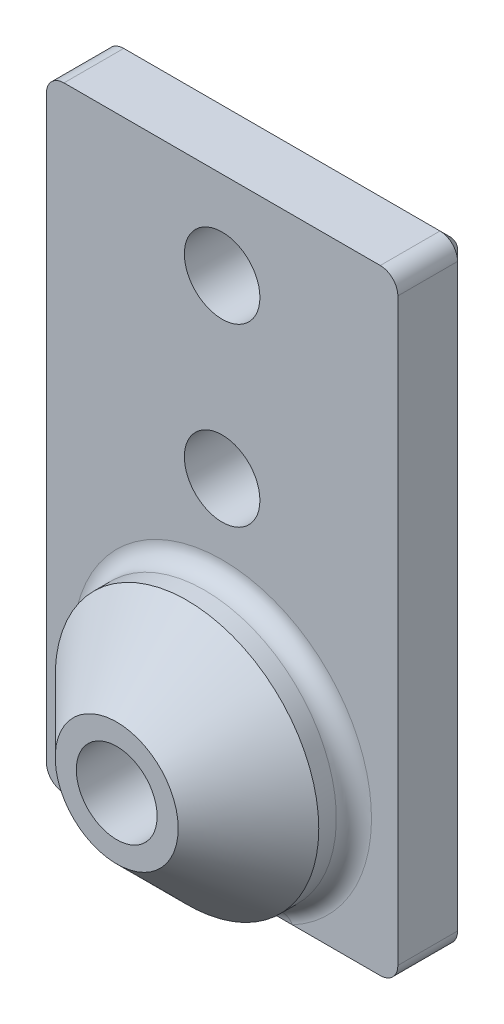
ISO-10303-21;
HEADER;
FILE_DESCRIPTION(('STEP AP214'),'2;1');
FILE_NAME('part.step','',(''),(''),'','','');
FILE_SCHEMA(('AUTOMOTIVE_DESIGN { 1 0 10303 214 1 1 1 1 }'));
ENDSEC;
DATA;
#1=APPLICATION_CONTEXT('core data for automotive mechanical design processes');
#2=APPLICATION_PROTOCOL_DEFINITION('international standard','automotive_design',2000,#1);
#3=PRODUCT_CONTEXT('',#1,'mechanical');
#4=PRODUCT('Part','Part','',(#3));
#5=PRODUCT_RELATED_PRODUCT_CATEGORY('part','',(#4));
#6=PRODUCT_DEFINITION_FORMATION('','',#4);
#7=PRODUCT_DEFINITION_CONTEXT('part definition',#1,'design');
#8=PRODUCT_DEFINITION('design','',#6,#7);
#9=PRODUCT_DEFINITION_SHAPE('','',#8);
#10=(LENGTH_UNIT() NAMED_UNIT(*) SI_UNIT(.MILLI.,.METRE.));
#11=(NAMED_UNIT(*) PLANE_ANGLE_UNIT() SI_UNIT($,.RADIAN.));
#12=(NAMED_UNIT(*) SI_UNIT($,.STERADIAN.) SOLID_ANGLE_UNIT());
#13=UNCERTAINTY_MEASURE_WITH_UNIT(LENGTH_MEASURE(1.E-05),#10,'distance_accuracy_value','');
#14=(GEOMETRIC_REPRESENTATION_CONTEXT(3) GLOBAL_UNCERTAINTY_ASSIGNED_CONTEXT((#13)) GLOBAL_UNIT_ASSIGNED_CONTEXT((#10,
#11,#12)) REPRESENTATION_CONTEXT('',''));
#15=CARTESIAN_POINT('',(0.,0.,0.));
#16=DIRECTION('',(0.,0.,1.));
#17=DIRECTION('',(1.,0.,0.));
#18=AXIS2_PLACEMENT_3D('',#15,#16,#17);
#19=CARTESIAN_POINT('',(0.,0.,4.));
#20=DIRECTION('',(0.,0.,1.));
#21=DIRECTION('',(1.,0.,0.));
#22=AXIS2_PLACEMENT_3D('',#19,#20,#21);
#23=PLANE('',#22);
#24=CARTESIAN_POINT('',(-10.,30.,4.));
#25=DIRECTION('',(0.,0.,1.));
#26=DIRECTION('',(1.,0.,0.));
#27=AXIS2_PLACEMENT_3D('',#24,#25,#26);
#28=CIRCLE('',#27,2.15);
#29=CARTESIAN_POINT('',(-7.85,30.,4.));
#30=VERTEX_POINT('',#29);
#31=EDGE_CURVE('E370',#30,#30,#28,.T.);
#32=ORIENTED_EDGE('',*,*,#31,.F.);
#33=EDGE_LOOP('',(#32));
#34=FACE_BOUND('',#33,.T.);
#35=DIRECTION('',(1.,0.,0.));
#36=VECTOR('',#35,1.);
#37=CARTESIAN_POINT('',(0.,0.,4.));
#38=LINE('',#37,#36);
#39=CARTESIAN_POINT('',(-19.,0.,4.));
#40=VERTEX_POINT('',#39);
#41=CARTESIAN_POINT('',(-14.,0.,4.));
#42=VERTEX_POINT('',#41);
#43=EDGE_CURVE('E180',#40,#42,#38,.T.);
#44=ORIENTED_EDGE('',*,*,#43,.T.);
#45=CARTESIAN_POINT('',(-10.,7.5,4.));
#46=DIRECTION('',(0.,0.,1.));
#47=DIRECTION('',(1.,0.,0.));
#48=AXIS2_PLACEMENT_3D('',#45,#46,#47);
#49=CIRCLE('',#48,8.5);
#50=CARTESIAN_POINT('',(-6.,0.,4.));
#51=VERTEX_POINT('',#50);
#52=EDGE_CURVE('E763',#42,#51,#49,.F.);
#53=ORIENTED_EDGE('',*,*,#52,.T.);
#54=CARTESIAN_POINT('',(-1.,0.,4.));
#55=VERTEX_POINT('',#54);
#56=EDGE_CURVE('E175',#51,#55,#38,.T.);
#57=ORIENTED_EDGE('',*,*,#56,.T.);
#58=CARTESIAN_POINT('',(-1.,1.,4.));
#59=DIRECTION('',(0.,0.,1.));
#60=DIRECTION('',(1.,0.,0.));
#61=AXIS2_PLACEMENT_3D('',#58,#59,#60);
#62=CIRCLE('',#61,1.);
#63=CARTESIAN_POINT('',(0.,1.,4.));
#64=VERTEX_POINT('',#63);
#65=EDGE_CURVE('E188',#55,#64,#62,.T.);
#66=ORIENTED_EDGE('',*,*,#65,.T.);
#67=DIRECTION('',(0.,1.,0.));
#68=VECTOR('',#67,1.);
#69=CARTESIAN_POINT('',(0.,0.,4.));
#70=LINE('',#69,#68);
#71=CARTESIAN_POINT('',(0.,34.,4.));
#72=VERTEX_POINT('',#71);
#73=EDGE_CURVE('E381',#64,#72,#70,.T.);
#74=ORIENTED_EDGE('',*,*,#73,.T.);
#75=CARTESIAN_POINT('',(-1.,34.,4.));
#76=DIRECTION('',(0.,0.,1.));
#77=DIRECTION('',(1.,0.,0.));
#78=AXIS2_PLACEMENT_3D('',#75,#76,#77);
#79=CIRCLE('',#78,1.);
#80=CARTESIAN_POINT('',(-1.,35.,4.));
#81=VERTEX_POINT('',#80);
#82=EDGE_CURVE('E766',#72,#81,#79,.T.);
#83=ORIENTED_EDGE('',*,*,#82,.T.);
#84=DIRECTION('',(-1.,0.,0.));
#85=VECTOR('',#84,1.);
#86=CARTESIAN_POINT('',(0.,35.,4.));
#87=LINE('',#86,#85);
#88=CARTESIAN_POINT('',(-19.,35.,4.));
#89=VERTEX_POINT('',#88);
#90=EDGE_CURVE('E391',#81,#89,#87,.T.);
#91=ORIENTED_EDGE('',*,*,#90,.T.);
#92=CARTESIAN_POINT('',(-19.,34.,4.));
#93=DIRECTION('',(0.,0.,1.));
#94=DIRECTION('',(1.,0.,0.));
#95=AXIS2_PLACEMENT_3D('',#92,#93,#94);
#96=CIRCLE('',#95,1.);
#97=CARTESIAN_POINT('',(-20.,34.,4.));
#98=VERTEX_POINT('',#97);
#99=EDGE_CURVE('E769',#89,#98,#96,.T.);
#100=ORIENTED_EDGE('',*,*,#99,.T.);
#101=DIRECTION('',(0.,-1.,0.));
#102=VECTOR('',#101,1.);
#103=CARTESIAN_POINT('',(-20.,0.,4.));
#104=LINE('',#103,#102);
#105=CARTESIAN_POINT('',(-20.,1.,4.));
#106=VERTEX_POINT('',#105);
#107=EDGE_CURVE('E395',#98,#106,#104,.T.);
#108=ORIENTED_EDGE('',*,*,#107,.T.);
#109=CARTESIAN_POINT('',(-19.,1.,4.));
#110=DIRECTION('',(0.,0.,1.));
#111=DIRECTION('',(1.,0.,0.));
#112=AXIS2_PLACEMENT_3D('',#109,#110,#111);
#113=CIRCLE('',#112,1.);
#114=EDGE_CURVE('E192',#106,#40,#113,.T.);
#115=ORIENTED_EDGE('',*,*,#114,.T.);
#116=EDGE_LOOP('',(#44,#53,#57,#66,#74,#83,#91,#100,#108,#115));
#117=FACE_BOUND('',#116,.T.);
#118=CARTESIAN_POINT('',(-10.,20.,4.));
#119=DIRECTION('',(0.,0.,1.));
#120=DIRECTION('',(1.,0.,0.));
#121=AXIS2_PLACEMENT_3D('',#118,#119,#120);
#122=CIRCLE('',#121,2.15);
#123=CARTESIAN_POINT('',(-7.85,20.,4.));
#124=VERTEX_POINT('',#123);
#125=EDGE_CURVE('E374',#124,#124,#122,.T.);
#126=ORIENTED_EDGE('',*,*,#125,.F.);
#127=EDGE_LOOP('',(#126));
#128=FACE_BOUND('',#127,.T.);
#129=ADVANCED_FACE('F43',(#34,#117,#128),#23,.T.);
#130=CARTESIAN_POINT('',(0.,0.,0.));
#131=DIRECTION('',(0.,0.,1.));
#132=DIRECTION('',(1.,0.,0.));
#133=AXIS2_PLACEMENT_3D('',#130,#131,#132);
#134=PLANE('',#133);
#135=CARTESIAN_POINT('',(-10.,20.,0.));
#136=DIRECTION('',(0.,0.,1.));
#137=DIRECTION('',(1.,0.,0.));
#138=AXIS2_PLACEMENT_3D('',#135,#136,#137);
#139=CIRCLE('',#138,2.75);
#140=CARTESIAN_POINT('',(-7.25,20.,0.));
#141=VERTEX_POINT('',#140);
#142=EDGE_CURVE('E643',#141,#141,#139,.T.);
#143=ORIENTED_EDGE('',*,*,#142,.T.);
#144=EDGE_LOOP('',(#143));
#145=FACE_BOUND('',#144,.T.);
#146=CARTESIAN_POINT('',(-10.,30.,0.));
#147=DIRECTION('',(0.,0.,1.));
#148=DIRECTION('',(1.,0.,0.));
#149=AXIS2_PLACEMENT_3D('',#146,#147,#148);
#150=CIRCLE('',#149,2.75000000000001);
#151=CARTESIAN_POINT('',(-7.25,30.,0.));
#152=VERTEX_POINT('',#151);
#153=EDGE_CURVE('E714',#152,#152,#150,.T.);
#154=ORIENTED_EDGE('',*,*,#153,.T.);
#155=EDGE_LOOP('',(#154));
#156=FACE_BOUND('',#155,.T.);
#157=DIRECTION('',(0.,1.,0.));
#158=VECTOR('',#157,1.);
#159=CARTESIAN_POINT('',(-19.4,0.,0.));
#160=LINE('',#159,#158);
#161=CARTESIAN_POINT('',(-19.4,1.,0.));
#162=VERTEX_POINT('',#161);
#163=CARTESIAN_POINT('',(-19.4,34.,0.));
#164=VERTEX_POINT('',#163);
#165=EDGE_CURVE('E707',#162,#164,#160,.T.);
#166=ORIENTED_EDGE('',*,*,#165,.T.);
#167=CARTESIAN_POINT('',(-19.,34.,0.));
#168=DIRECTION('',(0.,0.,1.));
#169=DIRECTION('',(1.,0.,0.));
#170=AXIS2_PLACEMENT_3D('',#167,#168,#169);
#171=CIRCLE('',#170,0.399999999999998);
#172=CARTESIAN_POINT('',(-19.,34.4,0.));
#173=VERTEX_POINT('',#172);
#174=EDGE_CURVE('E710',#164,#173,#171,.F.);
#175=ORIENTED_EDGE('',*,*,#174,.T.);
#176=DIRECTION('',(1.,0.,0.));
#177=VECTOR('',#176,1.);
#178=CARTESIAN_POINT('',(0.,34.4,0.));
#179=LINE('',#178,#177);
#180=CARTESIAN_POINT('',(-1.,34.4,0.));
#181=VERTEX_POINT('',#180);
#182=EDGE_CURVE('E277',#173,#181,#179,.T.);
#183=ORIENTED_EDGE('',*,*,#182,.T.);
#184=CARTESIAN_POINT('',(-1.,34.,0.));
#185=DIRECTION('',(0.,0.,1.));
#186=DIRECTION('',(1.,0.,0.));
#187=AXIS2_PLACEMENT_3D('',#184,#185,#186);
#188=CIRCLE('',#187,0.399999999999997);
#189=CARTESIAN_POINT('',(-0.600000000000003,34.,0.));
#190=VERTEX_POINT('',#189);
#191=EDGE_CURVE('E702',#181,#190,#188,.F.);
#192=ORIENTED_EDGE('',*,*,#191,.T.);
#193=DIRECTION('',(0.,-1.,0.));
#194=VECTOR('',#193,1.);
#195=CARTESIAN_POINT('',(-0.600000000000003,0.,0.));
#196=LINE('',#195,#194);
#197=CARTESIAN_POINT('',(-0.600000000000003,1.,0.));
#198=VERTEX_POINT('',#197);
#199=EDGE_CURVE('E688',#190,#198,#196,.T.);
#200=ORIENTED_EDGE('',*,*,#199,.T.);
#201=CARTESIAN_POINT('',(-1.,1.,0.));
#202=DIRECTION('',(0.,0.,1.));
#203=DIRECTION('',(1.,0.,0.));
#204=AXIS2_PLACEMENT_3D('',#201,#202,#203);
#205=CIRCLE('',#204,0.399999999999997);
#206=CARTESIAN_POINT('',(-1.,0.600000000000003,0.));
#207=VERTEX_POINT('',#206);
#208=EDGE_CURVE('E692',#198,#207,#205,.F.);
#209=ORIENTED_EDGE('',*,*,#208,.T.);
#210=DIRECTION('',(-1.,0.,0.));
#211=VECTOR('',#210,1.);
#212=CARTESIAN_POINT('',(0.,0.600000000000003,0.));
#213=LINE('',#212,#211);
#214=CARTESIAN_POINT('',(-19.,0.600000000000003,0.));
#215=VERTEX_POINT('',#214);
#216=EDGE_CURVE('E696',#207,#215,#213,.T.);
#217=ORIENTED_EDGE('',*,*,#216,.T.);
#218=CARTESIAN_POINT('',(-19.,1.,0.));
#219=DIRECTION('',(0.,0.,1.));
#220=DIRECTION('',(1.,0.,0.));
#221=AXIS2_PLACEMENT_3D('',#218,#219,#220);
#222=CIRCLE('',#221,0.399999999999998);
#223=EDGE_CURVE('E700',#215,#162,#222,.F.);
#224=ORIENTED_EDGE('',*,*,#223,.T.);
#225=EDGE_LOOP('',(#166,#175,#183,#192,#200,#209,#217,#224));
#226=FACE_BOUND('',#225,.T.);
#227=ADVANCED_FACE('F246',(#145,#156,#226),#134,.F.);
#228=CARTESIAN_POINT('',(0.,0.,4.));
#229=DIRECTION('',(-1.,0.,0.));
#230=DIRECTION('',(0.,0.,1.));
#231=AXIS2_PLACEMENT_3D('',#228,#229,#230);
#232=PLANE('',#231);
#233=DIRECTION('',(0.,0.,-1.));
#234=VECTOR('',#233,1.);
#235=CARTESIAN_POINT('',(0.,1.,4.));
#236=LINE('',#235,#234);
#237=CARTESIAN_POINT('',(0.,1.,0.600000000000007));
#238=VERTEX_POINT('',#237);
#239=EDGE_CURVE('E754',#64,#238,#236,.T.);
#240=ORIENTED_EDGE('',*,*,#239,.T.);
#241=DIRECTION('',(0.,1.,0.));
#242=VECTOR('',#241,1.);
#243=CARTESIAN_POINT('',(0.,0.,0.600000000000007));
#244=LINE('',#243,#242);
#245=CARTESIAN_POINT('',(0.,34.,0.600000000000007));
#246=VERTEX_POINT('',#245);
#247=EDGE_CURVE('E69',#238,#246,#244,.T.);
#248=ORIENTED_EDGE('',*,*,#247,.T.);
#249=DIRECTION('',(0.,0.,-1.));
#250=VECTOR('',#249,1.);
#251=CARTESIAN_POINT('',(0.,34.,4.));
#252=LINE('',#251,#250);
#253=EDGE_CURVE('E751',#246,#72,#252,.F.);
#254=ORIENTED_EDGE('',*,*,#253,.T.);
#255=ORIENTED_EDGE('',*,*,#73,.F.);
#256=EDGE_LOOP('',(#240,#248,#254,#255));
#257=FACE_BOUND('',#256,.T.);
#258=ADVANCED_FACE('F242',(#257),#232,.F.);
#259=CARTESIAN_POINT('',(0.,35.,4.));
#260=DIRECTION('',(0.,-1.,0.));
#261=DIRECTION('',(0.,0.,-1.));
#262=AXIS2_PLACEMENT_3D('',#259,#260,#261);
#263=PLANE('',#262);
#264=DIRECTION('',(0.,0.,-1.));
#265=VECTOR('',#264,1.);
#266=CARTESIAN_POINT('',(-1.,35.,4.));
#267=LINE('',#266,#265);
#268=CARTESIAN_POINT('',(-1.,35.,0.600000000000007));
#269=VERTEX_POINT('',#268);
#270=EDGE_CURVE('E757',#81,#269,#267,.T.);
#271=ORIENTED_EDGE('',*,*,#270,.T.);
#272=DIRECTION('',(-1.,0.,0.));
#273=VECTOR('',#272,1.);
#274=CARTESIAN_POINT('',(0.,35.,0.600000000000007));
#275=LINE('',#274,#273);
#276=CARTESIAN_POINT('',(-19.,35.,0.600000000000007));
#277=VERTEX_POINT('',#276);
#278=EDGE_CURVE('E11',#269,#277,#275,.T.);
#279=ORIENTED_EDGE('',*,*,#278,.T.);
#280=DIRECTION('',(0.,0.,-1.));
#281=VECTOR('',#280,1.);
#282=CARTESIAN_POINT('',(-19.,35.,4.));
#283=LINE('',#282,#281);
#284=EDGE_CURVE('E760',#277,#89,#283,.F.);
#285=ORIENTED_EDGE('',*,*,#284,.T.);
#286=ORIENTED_EDGE('',*,*,#90,.F.);
#287=EDGE_LOOP('',(#271,#279,#285,#286));
#288=FACE_BOUND('',#287,.T.);
#289=ADVANCED_FACE('F245',(#288),#263,.F.);
#290=CARTESIAN_POINT('',(-20.,0.,4.));
#291=DIRECTION('',(1.,0.,0.));
#292=DIRECTION('',(0.,1.,0.));
#293=AXIS2_PLACEMENT_3D('',#290,#291,#292);
#294=PLANE('',#293);
#295=DIRECTION('',(0.,0.,-1.));
#296=VECTOR('',#295,1.);
#297=CARTESIAN_POINT('',(-20.,34.,4.));
#298=LINE('',#297,#296);
#299=CARTESIAN_POINT('',(-20.,34.,0.600000000000007));
#300=VERTEX_POINT('',#299);
#301=EDGE_CURVE('E742',#98,#300,#298,.T.);
#302=ORIENTED_EDGE('',*,*,#301,.T.);
#303=DIRECTION('',(0.,-1.,0.));
#304=VECTOR('',#303,1.);
#305=CARTESIAN_POINT('',(-20.,0.,0.600000000000007));
#306=LINE('',#305,#304);
#307=CARTESIAN_POINT('',(-20.,1.,0.600000000000007));
#308=VERTEX_POINT('',#307);
#309=EDGE_CURVE('E640',#300,#308,#306,.T.);
#310=ORIENTED_EDGE('',*,*,#309,.T.);
#311=DIRECTION('',(0.,0.,-1.));
#312=VECTOR('',#311,1.);
#313=CARTESIAN_POINT('',(-20.,1.,4.));
#314=LINE('',#313,#312);
#315=EDGE_CURVE('E746',#308,#106,#314,.F.);
#316=ORIENTED_EDGE('',*,*,#315,.T.);
#317=ORIENTED_EDGE('',*,*,#107,.F.);
#318=EDGE_LOOP('',(#302,#310,#316,#317));
#319=FACE_BOUND('',#318,.T.);
#320=ADVANCED_FACE('F249',(#319),#294,.F.);
#321=CARTESIAN_POINT('',(0.,0.,4.));
#322=DIRECTION('',(0.,1.,0.));
#323=DIRECTION('',(0.,0.,1.));
#324=AXIS2_PLACEMENT_3D('',#321,#322,#323);
#325=PLANE('',#324);
#326=DIRECTION('',(0.,0.,-1.));
#327=VECTOR('',#326,1.);
#328=CARTESIAN_POINT('',(-19.,0.,4.));
#329=LINE('',#328,#327);
#330=CARTESIAN_POINT('',(-19.,0.,0.600000000000007));
#331=VERTEX_POINT('',#330);
#332=EDGE_CURVE('E423',#40,#331,#329,.T.);
#333=ORIENTED_EDGE('',*,*,#332,.T.);
#334=DIRECTION('',(1.,0.,0.));
#335=VECTOR('',#334,1.);
#336=CARTESIAN_POINT('',(0.,0.,0.600000000000007));
#337=LINE('',#336,#335);
#338=CARTESIAN_POINT('',(-1.,0.,0.600000000000007));
#339=VERTEX_POINT('',#338);
#340=EDGE_CURVE('E652',#331,#339,#337,.T.);
#341=ORIENTED_EDGE('',*,*,#340,.T.);
#342=DIRECTION('',(0.,0.,-1.));
#343=VECTOR('',#342,1.);
#344=CARTESIAN_POINT('',(-1.,0.,4.));
#345=LINE('',#344,#343);
#346=EDGE_CURVE('E738',#339,#55,#345,.F.);
#347=ORIENTED_EDGE('',*,*,#346,.T.);
#348=ORIENTED_EDGE('',*,*,#56,.F.);
#349=CARTESIAN_POINT('',(-10.,0.,4.));
#350=VERTEX_POINT('',#349);
#351=EDGE_CURVE('E168',#350,#51,#38,.T.);
#352=ORIENTED_EDGE('',*,*,#351,.F.);
#353=EDGE_CURVE('E172',#42,#350,#38,.T.);
#354=ORIENTED_EDGE('',*,*,#353,.F.);
#355=ORIENTED_EDGE('',*,*,#43,.F.);
#356=EDGE_LOOP('',(#333,#341,#347,#348,#352,#354,#355));
#357=FACE_BOUND('',#356,.T.);
#358=ADVANCED_FACE('F170',(#357),#325,.F.);
#359=CARTESIAN_POINT('',(-10.,30.,4.));
#360=DIRECTION('',(0.,0.,-1.));
#361=DIRECTION('',(-1.,0.,0.));
#362=AXIS2_PLACEMENT_3D('',#359,#360,#361);
#363=CYLINDRICAL_SURFACE('',#362,2.15);
#364=CARTESIAN_POINT('',(-10.,30.,0.600000000000007));
#365=DIRECTION('',(0.,0.,1.));
#366=DIRECTION('',(1.,0.,0.));
#367=AXIS2_PLACEMENT_3D('',#364,#365,#366);
#368=CIRCLE('',#367,2.15);
#369=CARTESIAN_POINT('',(-7.85,30.,0.600000000000007));
#370=VERTEX_POINT('',#369);
#371=EDGE_CURVE('E632',#370,#370,#368,.F.);
#372=ORIENTED_EDGE('',*,*,#371,.T.);
#373=EDGE_LOOP('',(#372));
#374=FACE_BOUND('',#373,.T.);
#375=ORIENTED_EDGE('',*,*,#31,.T.);
#376=EDGE_LOOP('',(#375));
#377=FACE_BOUND('',#376,.T.);
#378=ADVANCED_FACE('F257',(#374,#377),#363,.F.);
#379=CARTESIAN_POINT('',(-10.,20.,4.));
#380=DIRECTION('',(0.,0.,-1.));
#381=DIRECTION('',(-1.,0.,0.));
#382=AXIS2_PLACEMENT_3D('',#379,#380,#381);
#383=CYLINDRICAL_SURFACE('',#382,2.15);
#384=CARTESIAN_POINT('',(-10.,20.,0.599999999999997));
#385=DIRECTION('',(0.,0.,1.));
#386=DIRECTION('',(1.,0.,0.));
#387=AXIS2_PLACEMENT_3D('',#384,#385,#386);
#388=CIRCLE('',#387,2.15);
#389=CARTESIAN_POINT('',(-7.85,20.,0.599999999999997));
#390=VERTEX_POINT('',#389);
#391=EDGE_CURVE('E635',#390,#390,#388,.F.);
#392=ORIENTED_EDGE('',*,*,#391,.T.);
#393=EDGE_LOOP('',(#392));
#394=FACE_BOUND('',#393,.T.);
#395=ORIENTED_EDGE('',*,*,#125,.T.);
#396=EDGE_LOOP('',(#395));
#397=FACE_BOUND('',#396,.T.);
#398=ADVANCED_FACE('F210',(#394,#397),#383,.F.);
#399=CARTESIAN_POINT('',(-10.,7.5,10.));
#400=DIRECTION('',(0.,0.,-1.));
#401=DIRECTION('',(-1.,0.,0.));
#402=AXIS2_PLACEMENT_3D('',#399,#400,#401);
#403=CYLINDRICAL_SURFACE('',#402,7.5);
#404=CARTESIAN_POINT('',(-10.,7.5,5.99999999999999));
#405=DIRECTION('',(0.,0.,1.));
#406=DIRECTION('',(1.,0.,0.));
#407=AXIS2_PLACEMENT_3D('',#404,#405,#406);
#408=CIRCLE('',#407,7.5);
#409=CARTESIAN_POINT('',(-2.5,7.5,5.99999999999999));
#410=VERTEX_POINT('',#409);
#411=EDGE_CURVE('E163',#410,#410,#408,.F.);
#412=ORIENTED_EDGE('',*,*,#411,.T.);
#413=EDGE_LOOP('',(#412));
#414=FACE_BOUND('',#413,.T.);
#415=CARTESIAN_POINT('',(-14.1649475880082,1.26275609029561,4.90229289493559));
#416=CARTESIAN_POINT('',(-13.8545563329807,1.05549093798143,3.49567704368993));
#417=CARTESIAN_POINT('',(-14.720273933076,0.,4.));
#418=CARTESIAN_POINT('',(-14.1081716865762,1.22482939027456,4.92276098989987));
#419=CARTESIAN_POINT('',(-13.847450596458,1.05467265586705,3.55648185499084));
#420=CARTESIAN_POINT('',(-14.6559279115267,0.,4.));
#421=CARTESIAN_POINT('',(-14.0502097337292,1.18725976905072,4.93941284545202));
#422=CARTESIAN_POINT('',(-13.8311114251331,1.04709075751968,3.61505026043743));
#423=CARTESIAN_POINT('',(-14.5902376983066,0.,4.));
#424=CARTESIAN_POINT('',(-13.9325541201053,1.11331183799878,4.96614979707921));
#425=CARTESIAN_POINT('',(-13.7843973451678,1.02251750961405,3.72306183013039));
#426=CARTESIAN_POINT('',(-14.4568946695027,0.,4.));
#427=CARTESIAN_POINT('',(-13.8728647861583,1.07693096791913,4.97625002962831));
#428=CARTESIAN_POINT('',(-13.7546079875344,1.00592715447734,3.77305899488127));
#429=CARTESIAN_POINT('',(-14.3892467576593,0.,4.));
#430=CARTESIAN_POINT('',(-13.7527153473693,1.00600559783821,4.99096212055038));
#431=CARTESIAN_POINT('',(-13.6854384794004,0.967433010639359,3.86348648380602));
#432=CARTESIAN_POINT('',(-14.2530773936721,0.,4.));
#433=CARTESIAN_POINT('',(-13.6922684287483,0.971446653440109,4.9956265221784));
#434=CARTESIAN_POINT('',(-13.6464531399414,0.945747802655388,3.90444876729883));
#435=CARTESIAN_POINT('',(-14.1845708859114,0.,4.));
#436=CARTESIAN_POINT('',(-13.5702912787392,0.903949485952248,5.00043524049742));
#437=CARTESIAN_POINT('',(-13.5613694166655,0.899347327653967,3.97834418579003));
#438=CARTESIAN_POINT('',(-14.0463301159081,0.,4.));
#439=CARTESIAN_POINT('',(-13.5087602351017,0.871012554895877,5.00057601018014));
#440=CARTESIAN_POINT('',(-13.5154033937907,0.874676048334971,4.01163415173637));
#441=CARTESIAN_POINT('',(-13.9765949331162,0.,4.));
#442=CARTESIAN_POINT('',(-13.3329493568269,0.780039416386298,4.99550686004393));
#443=CARTESIAN_POINT('',(-13.3792204070121,0.803585262072281,4.09486897573657));
#444=CARTESIAN_POINT('',(-13.7773426044021,0.,4.));
#445=CARTESIAN_POINT('',(-13.2176780323049,0.724101086614,4.98571396482374));
#446=CARTESIAN_POINT('',(-13.2811776533496,0.754499914540078,4.13868622529417));
#447=CARTESIAN_POINT('',(-13.6467017699481,0.,4.));
#448=CARTESIAN_POINT('',(-12.9852675044558,0.618539479915718,4.95624128269234));
#449=CARTESIAN_POINT('',(-13.0744301649749,0.657547653044931,4.20700267540133));
#450=CARTESIAN_POINT('',(-13.38330317172,0.,4.));
#451=CARTESIAN_POINT('',(-12.86812741034,0.568919322430786,4.93655663551524));
#452=CARTESIAN_POINT('',(-12.9655301348853,0.609317456658071,4.23256442694132));
#453=CARTESIAN_POINT('',(-13.2505443983853,0.,4.));
#454=CARTESIAN_POINT('',(-12.631666465581,0.475713675629504,4.88937034766529));
#455=CARTESIAN_POINT('',(-12.7402627084352,0.516573773962627,4.26918112839281));
#456=CARTESIAN_POINT('',(-12.9825553276585,0.,4.));
#457=CARTESIAN_POINT('',(-12.5123358764015,0.432175797421271,4.86181167536852));
#458=CARTESIAN_POINT('',(-12.6234202217676,0.471666266817686,4.2807726339324));
#459=CARTESIAN_POINT('',(-12.8473139932587,0.,4.));
#460=CARTESIAN_POINT('',(-12.2727000243456,0.351515559521142,4.80067566588278));
#461=CARTESIAN_POINT('',(-12.3853772502595,0.387403291822462,4.29270907321894));
#462=CARTESIAN_POINT('',(-12.5757266942619,0.,4.));
#463=CARTESIAN_POINT('',(-12.1523944709402,0.314395191734235,4.76709646657124));
#464=CARTESIAN_POINT('',(-12.2636952926455,0.347670357296341,4.2934127189203));
#465=CARTESIAN_POINT('',(-12.4393804003989,0.,4.));
#466=CARTESIAN_POINT('',(-11.8650094582228,0.233520160112117,4.68158689215629));
#467=CARTESIAN_POINT('',(-11.9718504877983,0.260965663687424,4.28501588070591));
#468=CARTESIAN_POINT('',(-12.1136773859859,0.,4.));
#469=CARTESIAN_POINT('',(-11.6976034654752,0.192641029846364,4.62754405559441));
#470=CARTESIAN_POINT('',(-11.7979073466423,0.215751725011192,4.27242516417799));
#471=CARTESIAN_POINT('',(-11.9239505942123,0.,4.));
#472=CARTESIAN_POINT('',(-11.3619462397298,0.122701819703047,4.5134325796347));
#473=CARTESIAN_POINT('',(-11.4475950590523,0.138386101801871,4.2365191065914));
#474=CARTESIAN_POINT('',(-11.5435390717023,0.,4.));
#475=CARTESIAN_POINT('',(-11.1936946916544,0.0936465368237265,4.4533615068454));
#476=CARTESIAN_POINT('',(-11.2698691357922,0.105625536893205,4.21330293865327));
#477=CARTESIAN_POINT('',(-11.3528539838778,0.,4.));
#478=CARTESIAN_POINT('',(-10.6892636110927,0.0240504271235652,4.26791095870411));
#479=CARTESIAN_POINT('',(-10.7405324431571,0.0282636587509294,4.1347123662954));
#480=CARTESIAN_POINT('',(-10.7811654258994,0.,4.));
#481=CARTESIAN_POINT('',(-10.352063184578,0.000706355071286015,4.13685717667344));
#482=CARTESIAN_POINT('',(-10.3756133926454,0.000812763171856406,4.06843987790779));
#483=CARTESIAN_POINT('',(-10.3990049425217,0.,4.));
#484=CARTESIAN_POINT('',(-10.0102596632133,5.26710091234347E-06,4.00398822213753));
#485=CARTESIAN_POINT('',(-10.0109436346984,5.78573264473312E-06,4.00199412971753));
#486=CARTESIAN_POINT('',(-10.0116276183084,0.,4.));
#487=CARTESIAN_POINT('',(-10.0051297670904,4.33109064626581E-09,4.00199407655141));
#488=CARTESIAN_POINT('',(-10.0054717266016,-1.84026510999685E-07,4.00099705388527));
#489=CARTESIAN_POINT('',(-10.0058137360358,0.,4.));
#490=CARTESIAN_POINT('',(-10.,0.,4.));
#491=CARTESIAN_POINT('',(-10.,0.,4.));
#492=CARTESIAN_POINT('',(-10.,0.,4.));
#493=(BOUNDED_SURFACE() B_SPLINE_SURFACE(3,2,((#415,#416,#417),(#418,#419,#420),(#421,#422,
#423),(#424,#425,#426),(#427,#428,#429),(#430,#431,#432),(#433,#434,#435),(#436,#437,#438),
(#439,#440,#441),(#442,#443,#444),(#445,#446,#447),(#448,#449,#450),(#451,#452,#453),(#454,#455,
#456),(#457,#458,#459),(#460,#461,#462),(#463,#464,#465),(#466,#467,#468),(#469,#470,#471),
(#472,#473,#474),(#475,#476,#477),(#478,#479,#480),(#481,#482,#483),(#484,#485,#486),(#487,#488,
#489),(#490,#491,#492)),.UNSPECIFIED.,.F.,.F.,.F.) B_SPLINE_SURFACE_WITH_KNOTS((4,2,2,2,2,2,2,2,
2,2,2,2,4),(3,3),(0.,0.239864757982924,0.479173354289037,0.716149064431818,0.953310584190613,
1.38922377044919,1.82535135033743,2.2647215636672,2.70422790744428,3.31148565065602,
3.91898951655747,5.12911295447538,5.14755205207324),(0.,1.),
.UNSPECIFIED.) GEOMETRIC_REPRESENTATION_ITEM() RATIONAL_B_SPLINE_SURFACE(((1.,0.566331890026464,
1.),(1.,0.581144498261973,1.),(1.,0.595533894529261,1.),(1.,0.623412455339675,1.),(1.,
0.636903629843126,1.),(1.,0.662873620182135,1.),(1.,0.675361022843118,1.),(1.,0.699497324293082,
1.),(1.,0.711145557944764,1.),(1.,0.743043242293425,1.),(1.,0.762320135751716,1.),(1.,
0.798296638400172,1.),(1.,0.814994975350845,1.),(1.,0.846103702394589,1.),(1.,0.860496158386932,
1.),(1.,0.886995872404585,1.),(1.,0.899102421023457,1.),(1.,0.925359675676646,1.),(1.,
0.93852690815901,1.),(1.,0.960967510949292,1.),(1.,0.970239300904672,1.),(1.,0.99240769859094,
1.),(1.,0.999776680741857,1.),(1.,0.999998326598449,1.),(1.,0.999999992986933,1.),(1.,1.,1.))) REPRESENTATION_ITEM('') SURFACE());
#494=CARTESIAN_POINT('',(-14.1649475880082,1.26275609029561,4.90229289493559));
#495=CARTESIAN_POINT('',(-14.1081716865762,1.22482939027456,4.92276098989987));
#496=CARTESIAN_POINT('',(-14.0502097337292,1.18725976905072,4.93941284545202));
#497=CARTESIAN_POINT('',(-13.9325541201053,1.11331183799878,4.96614979707921));
#498=CARTESIAN_POINT('',(-13.8728647861583,1.07693096791913,4.97625002962831));
#499=CARTESIAN_POINT('',(-13.7527153473693,1.00600559783821,4.99096212055038));
#500=CARTESIAN_POINT('',(-13.6922684287483,0.971446653440109,4.9956265221784));
#501=CARTESIAN_POINT('',(-13.5702912787392,0.903949485952248,5.00043524049742));
#502=CARTESIAN_POINT('',(-13.5087602351017,0.871012554895877,5.00057601018014));
#503=CARTESIAN_POINT('',(-13.3329493568269,0.780039416386298,4.99550686004393));
#504=CARTESIAN_POINT('',(-13.2176780323049,0.724101086614,4.98571396482374));
#505=CARTESIAN_POINT('',(-12.9852675044558,0.618539479915718,4.95624128269234));
#506=CARTESIAN_POINT('',(-12.86812741034,0.568919322430786,4.93655663551524));
#507=CARTESIAN_POINT('',(-12.631666465581,0.475713675629504,4.88937034766529));
#508=CARTESIAN_POINT('',(-12.5123358764015,0.432175797421271,4.86181167536852));
#509=CARTESIAN_POINT('',(-12.2727000243456,0.351515559521142,4.80067566588278));
#510=CARTESIAN_POINT('',(-12.1523944709402,0.314395191734235,4.76709646657124));
#511=CARTESIAN_POINT('',(-11.8650094582228,0.233520160112117,4.68158689215629));
#512=CARTESIAN_POINT('',(-11.6976034654752,0.192641029846364,4.62754405559441));
#513=CARTESIAN_POINT('',(-11.3619462397298,0.122701819703047,4.5134325796347));
#514=CARTESIAN_POINT('',(-11.1936946916544,0.0936465368237265,4.4533615068454));
#515=CARTESIAN_POINT('',(-10.6892636110927,0.0240504271235652,4.26791095870411));
#516=CARTESIAN_POINT('',(-10.352063184578,0.000706355071286015,4.13685717667344));
#517=CARTESIAN_POINT('',(-10.0102596632133,5.26710091234327E-06,4.00398822213753));
#518=CARTESIAN_POINT('',(-10.0051297670904,4.33109064606159E-09,4.00199407655141));
#519=CARTESIAN_POINT('',(-10.,0.,4.));
#520=B_SPLINE_CURVE_WITH_KNOTS('',3,(#494,#495,#496,#497,#498,#499,#500,#501,#502,#503,#504,
#505,#506,#507,#508,#509,#510,#511,#512,#513,#514,#515,#516,#517,#518,#519),.UNSPECIFIED.,.F.,
.F.,(4,2,2,2,2,2,2,2,2,2,2,2,4),(0.,0.239864757982924,0.479173354289037,0.716149064431818,
0.953310584190613,1.38922377044919,1.82535135033743,2.2647215636672,2.70422790744428,
3.31148565065602,3.91898951655747,5.12911295447538,5.14755205207324),.UNSPECIFIED.);
#521=CARTESIAN_POINT('',(-13.5294117647059,0.88235294117647,5.));
#522=VERTEX_POINT('',#521);
#523=EDGE_CURVE('E151',#522,#350,#520,.T.);
#524=ORIENTED_EDGE('',*,*,#523,.T.);
#525=CARTESIAN_POINT('',(-5.27972606692308,0.,4.));
#526=CARTESIAN_POINT('',(-6.14544366701916,1.05549093798144,3.49567704368902));
#527=CARTESIAN_POINT('',(-5.83505241199095,1.26275609029616,4.90229289493529));
#528=CARTESIAN_POINT('',(-5.34407208847224,0.,4.));
#529=CARTESIAN_POINT('',(-6.15254940354174,1.05467265586713,3.5564818549899));
#530=CARTESIAN_POINT('',(-5.89182831342286,1.22482939027515,4.92276098989959));
#531=CARTESIAN_POINT('',(-5.40976230169226,0.,4.));
#532=CARTESIAN_POINT('',(-6.16888857486659,1.04709075751983,3.61505026043647));
#533=CARTESIAN_POINT('',(-5.94979026626987,1.18725976905134,4.93941284545175));
#534=CARTESIAN_POINT('',(-5.54310533049608,0.,4.));
#535=CARTESIAN_POINT('',(-6.21560265483165,1.02251750961433,3.72306183012943));
#536=CARTESIAN_POINT('',(-6.06744587989362,1.11331183799946,4.966149797079));
#537=CARTESIAN_POINT('',(-5.61075324233932,0.,4.));
#538=CARTESIAN_POINT('',(-6.24539201246496,1.00592715447768,3.77305899488031));
#539=CARTESIAN_POINT('',(-6.12713521384055,1.07693096791984,4.97625002962813));
#540=CARTESIAN_POINT('',(-5.74692260632644,0.,4.));
#541=CARTESIAN_POINT('',(-6.3145615205988,0.967433010639815,3.86348648380508));
#542=CARTESIAN_POINT('',(-6.24728465262936,1.00600559783898,4.99096212055025));
#543=CARTESIAN_POINT('',(-5.81542911408704,0.,4.));
#544=CARTESIAN_POINT('',(-6.35354686005769,0.945747802655895,3.90444876729792));
#545=CARTESIAN_POINT('',(-6.30773157125029,0.971446653440896,4.9956265221783));
#546=CARTESIAN_POINT('',(-5.9536698840902,0.,4.));
#547=CARTESIAN_POINT('',(-6.43863058333335,0.899347327654566,3.97834418578918));
#548=CARTESIAN_POINT('',(-6.42970872125931,0.903949485953073,5.0004352404974));
#549=CARTESIAN_POINT('',(-6.023405066882,0.,4.));
#550=CARTESIAN_POINT('',(-6.48459660620813,0.874676048335611,4.01163415173555));
#551=CARTESIAN_POINT('',(-6.49123976489672,0.871012554896717,5.00057601018016));
#552=CARTESIAN_POINT('',(-6.22265739559587,0.,4.));
#553=CARTESIAN_POINT('',(-6.6207795929864,0.803585262073026,4.09486897573583));
#554=CARTESIAN_POINT('',(-6.66705064317129,0.78003941638718,4.99550686004404));
#555=CARTESIAN_POINT('',(-6.35329823004979,0.,4.));
#556=CARTESIAN_POINT('',(-6.71882234664878,0.75449991454088,4.1386862252935));
#557=CARTESIAN_POINT('',(-6.78232196769324,0.724101086614905,4.98571396482392));
#558=CARTESIAN_POINT('',(-6.61669682827758,0.,4.));
#559=CARTESIAN_POINT('',(-6.92556983502312,0.65754765304582,4.20700267540081));
#560=CARTESIAN_POINT('',(-7.01473249554204,0.618539479916656,4.95624128269267));
#561=CARTESIAN_POINT('',(-6.74945560161212,0.,4.));
#562=CARTESIAN_POINT('',(-7.03446986511256,0.609317456658992,4.23256442694087));
#563=CARTESIAN_POINT('',(-7.13187258965771,0.568919322431732,4.93655663551564));
#564=CARTESIAN_POINT('',(-7.01744467233863,0.,4.));
#565=CARTESIAN_POINT('',(-7.25973729156232,0.516573773963593,4.26918112839251));
#566=CARTESIAN_POINT('',(-7.36833353441649,0.475713675630455,4.88937034766585));
#567=CARTESIAN_POINT('',(-7.15268600673824,0.,4.));
#568=CARTESIAN_POINT('',(-7.37657977822974,0.471666266818665,4.28077263393218));
#569=CARTESIAN_POINT('',(-7.48766412359581,0.43217579742222,4.86181167536915));
#570=CARTESIAN_POINT('',(-7.42427330573475,0.,4.));
#571=CARTESIAN_POINT('',(-7.61462274973754,0.387403291823448,4.29270907321887));
#572=CARTESIAN_POINT('',(-7.72729997565152,0.351515559522073,4.80067566588357));
#573=CARTESIAN_POINT('',(-7.56061959959764,0.,4.));
#574=CARTESIAN_POINT('',(-7.73630470735136,0.347670357297321,4.29341271892031));
#575=CARTESIAN_POINT('',(-7.84760552905672,0.314395191735152,4.76709646657212));
#576=CARTESIAN_POINT('',(-7.88632261401082,0.,4.));
#577=CARTESIAN_POINT('',(-8.02814951219862,0.260965663688241,4.28501588070609));
#578=CARTESIAN_POINT('',(-8.13499054177428,0.233520160112861,4.68158689215721));
#579=CARTESIAN_POINT('',(-8.07604940578469,0.,4.));
#580=CARTESIAN_POINT('',(-8.20209265335493,0.215751725011868,4.27242516417821));
#581=CARTESIAN_POINT('',(-8.30239653452216,0.192641029846977,4.62754405559527));
#582=CARTESIAN_POINT('',(-8.45646092829529,0.,4.));
#583=CARTESIAN_POINT('',(-8.55240494094542,0.138386101802307,4.23651910659169));
#584=CARTESIAN_POINT('',(-8.63805376026805,0.122701819703433,4.51343257963548));
#585=CARTESIAN_POINT('',(-8.64714601612012,0.,4.));
#586=CARTESIAN_POINT('',(-8.73013086420581,0.105625536893538,4.21330293865359));
#587=CARTESIAN_POINT('',(-8.80630530834378,0.0936465368240174,4.45336150684616));
#588=CARTESIAN_POINT('',(-9.21883457409934,0.,4.));
#589=CARTESIAN_POINT('',(-9.25946755684172,0.0282636587510244,4.13471236629553));
#590=CARTESIAN_POINT('',(-9.3107363889062,0.0240504271236466,4.26791095870439));
#591=CARTESIAN_POINT('',(-9.60099505747743,0.,4.));
#592=CARTESIAN_POINT('',(-9.62438660735375,0.000812763171861956,4.06843987790745));
#593=CARTESIAN_POINT('',(-9.64793681542117,0.000706355071329923,4.13685717667281));
#594=CARTESIAN_POINT('',(-9.98837238169158,0.,4.));
#595=CARTESIAN_POINT('',(-9.9890563653016,5.78573264422229E-06,4.00199412971752));
#596=CARTESIAN_POINT('',(-9.98974033678669,5.26710091300747E-06,4.00398822213751));
#597=CARTESIAN_POINT('',(-9.99418626396421,0.,4.));
#598=CARTESIAN_POINT('',(-9.99452827339837,-1.84026511582802E-07,4.00099705388527));
#599=CARTESIAN_POINT('',(-9.9948702329096,4.33109065986191E-09,4.0019940765514));
#600=CARTESIAN_POINT('',(-10.,0.,4.));
#601=CARTESIAN_POINT('',(-10.,0.,4.));
#602=CARTESIAN_POINT('',(-10.,0.,4.));
#603=(BOUNDED_SURFACE() B_SPLINE_SURFACE(3,2,((#525,#526,#527),(#528,#529,#530),(#531,#532,
#533),(#534,#535,#536),(#537,#538,#539),(#540,#541,#542),(#543,#544,#545),(#546,#547,#548),
(#549,#550,#551),(#552,#553,#554),(#555,#556,#557),(#558,#559,#560),(#561,#562,#563),(#564,#565,
#566),(#567,#568,#569),(#570,#571,#572),(#573,#574,#575),(#576,#577,#578),(#579,#580,#581),
(#582,#583,#584),(#585,#586,#587),(#588,#589,#590),(#591,#592,#593),(#594,#595,#596),(#597,#598,
#599),(#600,#601,#602)),.UNSPECIFIED.,.F.,.F.,.F.) B_SPLINE_SURFACE_WITH_KNOTS((4,2,2,2,2,2,2,2,
2,2,2,2,4),(3,3),(0.,0.239864757982677,0.479173354288548,0.716149064431101,0.953310584189674,
1.38922377044783,1.82535135033563,2.26472156366495,2.70422790744158,3.31148565065429,
3.9189895165567,5.12911295447653,5.1475520520744),(0.,1.),
.UNSPECIFIED.) GEOMETRIC_REPRESENTATION_ITEM() RATIONAL_B_SPLINE_SURFACE(((1.,0.566331890026248,
1.),(1.,0.581144498261746,1.),(1.,0.595533894529023,1.),(1.,0.623412455339419,1.),(1.,
0.636903629842862,1.),(1.,0.662873620181857,1.),(1.,0.675361022842835,1.),(1.,0.699497324292789,
1.),(1.,0.711145557944467,1.),(1.,0.743043242293119,1.),(1.,0.762320135751405,1.),(1.,
0.798296638399856,1.),(1.,0.814994975350528,1.),(1.,0.846103702394273,1.),(1.,0.860496158386619,
1.),(1.,0.88699587240428,1.),(1.,0.899102421023159,1.),(1.,0.925359675676406,1.),(1.,
0.938526908158814,1.),(1.,0.960967510949168,1.),(1.,0.970239300904577,1.),(1.,0.992407698590916,
1.),(1.,0.999776680741856,1.),(1.,0.999998326598449,1.),(1.,0.999999992986933,1.),(1.,1.,1.))) REPRESENTATION_ITEM('') SURFACE());
#604=CARTESIAN_POINT('',(-5.83505241199095,1.26275609029616,4.90229289493529));
#605=CARTESIAN_POINT('',(-5.89182831342286,1.22482939027515,4.92276098989958));
#606=CARTESIAN_POINT('',(-5.94979026626987,1.18725976905134,4.93941284545175));
#607=CARTESIAN_POINT('',(-6.06744587989362,1.11331183799946,4.966149797079));
#608=CARTESIAN_POINT('',(-6.12713521384055,1.07693096791984,4.97625002962813));
#609=CARTESIAN_POINT('',(-6.24728465262936,1.00600559783898,4.99096212055025));
#610=CARTESIAN_POINT('',(-6.30773157125029,0.971446653440896,4.9956265221783));
#611=CARTESIAN_POINT('',(-6.42970872125931,0.903949485953073,5.0004352404974));
#612=CARTESIAN_POINT('',(-6.49123976489672,0.871012554896717,5.00057601018016));
#613=CARTESIAN_POINT('',(-6.66705064317129,0.78003941638718,4.99550686004404));
#614=CARTESIAN_POINT('',(-6.78232196769324,0.724101086614905,4.98571396482392));
#615=CARTESIAN_POINT('',(-7.01473249554204,0.618539479916656,4.95624128269267));
#616=CARTESIAN_POINT('',(-7.13187258965771,0.568919322431732,4.93655663551564));
#617=CARTESIAN_POINT('',(-7.36833353441649,0.475713675630455,4.88937034766585));
#618=CARTESIAN_POINT('',(-7.48766412359582,0.43217579742222,4.86181167536915));
#619=CARTESIAN_POINT('',(-7.72729997565152,0.351515559522073,4.80067566588357));
#620=CARTESIAN_POINT('',(-7.84760552905672,0.314395191735152,4.76709646657212));
#621=CARTESIAN_POINT('',(-8.13499054177428,0.233520160112861,4.68158689215722));
#622=CARTESIAN_POINT('',(-8.30239653452216,0.192641029846977,4.62754405559527));
#623=CARTESIAN_POINT('',(-8.63805376026805,0.122701819703433,4.51343257963548));
#624=CARTESIAN_POINT('',(-8.80630530834378,0.0936465368240174,4.45336150684616));
#625=CARTESIAN_POINT('',(-9.3107363889062,0.0240504271236467,4.26791095870438));
#626=CARTESIAN_POINT('',(-9.64793681542117,0.000706355071329924,4.1368571766728));
#627=CARTESIAN_POINT('',(-9.98974033678669,5.26710091300736E-06,4.00398822213751));
#628=CARTESIAN_POINT('',(-9.9948702329096,4.33109065975228E-09,4.0019940765514));
#629=CARTESIAN_POINT('',(-10.,0.,4.));
#630=B_SPLINE_CURVE_WITH_KNOTS('',3,(#604,#605,#606,#607,#608,#609,#610,#611,#612,#613,#614,
#615,#616,#617,#618,#619,#620,#621,#622,#623,#624,#625,#626,#627,#628,#629),.UNSPECIFIED.,.F.,
.F.,(4,2,2,2,2,2,2,2,2,2,2,2,4),(0.,0.239864757982677,0.479173354288548,0.716149064431101,
0.953310584189674,1.38922377044783,1.82535135033563,2.26472156366495,2.70422790744158,
3.31148565065429,3.9189895165567,5.12911295447653,5.1475520520744),.UNSPECIFIED.);
#631=CARTESIAN_POINT('',(-6.47058823529412,0.882352941176471,5.));
#632=VERTEX_POINT('',#631);
#633=EDGE_CURVE('E155',#350,#632,#630,.F.);
#634=ORIENTED_EDGE('',*,*,#633,.T.);
#635=CARTESIAN_POINT('',(-10.,7.5,5.));
#636=DIRECTION('',(0.,0.,1.));
#637=DIRECTION('',(1.,0.,0.));
#638=AXIS2_PLACEMENT_3D('',#635,#636,#637);
#639=CIRCLE('',#638,7.5);
#640=EDGE_CURVE('E157',#632,#522,#639,.T.);
#641=ORIENTED_EDGE('',*,*,#640,.T.);
#642=EDGE_LOOP('',(#524,#634,#641));
#643=FACE_BOUND('',#642,.T.);
#644=ADVANCED_FACE('F153',(#414,#643),#403,.T.);
#645=CARTESIAN_POINT('',(-10.,7.5,10.));
#646=DIRECTION('',(0.,0.,1.));
#647=DIRECTION('',(1.,0.,0.));
#648=AXIS2_PLACEMENT_3D('',#645,#646,#647);
#649=PLANE('',#648);
#650=CARTESIAN_POINT('',(-10.,7.5,10.));
#651=DIRECTION('',(0.,0.,1.));
#652=DIRECTION('',(1.,0.,0.));
#653=AXIS2_PLACEMENT_3D('',#650,#651,#652);
#654=CIRCLE('',#653,3.5);
#655=CARTESIAN_POINT('',(-6.5,7.5,10.));
#656=VERTEX_POINT('',#655);
#657=EDGE_CURVE('E399',#656,#656,#654,.T.);
#658=ORIENTED_EDGE('',*,*,#657,.T.);
#659=EDGE_LOOP('',(#658));
#660=FACE_BOUND('',#659,.T.);
#661=CARTESIAN_POINT('',(-10.,7.5,10.));
#662=DIRECTION('',(0.,0.,1.));
#663=DIRECTION('',(1.,0.,0.));
#664=AXIS2_PLACEMENT_3D('',#661,#662,#663);
#665=CIRCLE('',#664,2.3);
#666=CARTESIAN_POINT('',(-7.7,7.5,10.));
#667=VERTEX_POINT('',#666);
#668=EDGE_CURVE('E384',#667,#667,#665,.T.);
#669=ORIENTED_EDGE('',*,*,#668,.F.);
#670=EDGE_LOOP('',(#669));
#671=FACE_BOUND('',#670,.T.);
#672=ADVANCED_FACE('F209',(#660,#671),#649,.T.);
#673=CARTESIAN_POINT('',(-10.,7.5,3.));
#674=DIRECTION('',(0.,0.,1.));
#675=DIRECTION('',(1.,0.,0.));
#676=AXIS2_PLACEMENT_3D('',#673,#674,#675);
#677=CYLINDRICAL_SURFACE('',#676,2.3);
#678=CARTESIAN_POINT('',(-10.,7.5,3.));
#679=DIRECTION('',(0.,0.,1.));
#680=DIRECTION('',(1.,0.,0.));
#681=AXIS2_PLACEMENT_3D('',#678,#679,#680);
#682=CIRCLE('',#681,2.3);
#683=CARTESIAN_POINT('',(-7.7,7.5,3.));
#684=VERTEX_POINT('',#683);
#685=EDGE_CURVE('E377',#684,#684,#682,.T.);
#686=ORIENTED_EDGE('',*,*,#685,.F.);
#687=EDGE_LOOP('',(#686));
#688=FACE_BOUND('',#687,.T.);
#689=ORIENTED_EDGE('',*,*,#668,.T.);
#690=EDGE_LOOP('',(#689));
#691=FACE_BOUND('',#690,.T.);
#692=ADVANCED_FACE('F411',(#688,#691),#677,.F.);
#693=CARTESIAN_POINT('',(-10.,7.5,3.));
#694=DIRECTION('',(0.,0.,1.));
#695=DIRECTION('',(1.,0.,0.));
#696=AXIS2_PLACEMENT_3D('',#693,#694,#695);
#697=PLANE('',#696);
#698=ORIENTED_EDGE('',*,*,#685,.T.);
#699=EDGE_LOOP('',(#698));
#700=FACE_BOUND('',#699,.T.);
#701=ADVANCED_FACE('F240',(#700),#697,.T.);
#702=CARTESIAN_POINT('',(-10.,7.5,10.));
#703=DIRECTION('',(0.,0.,-1.));
#704=DIRECTION('',(-1.,0.,0.));
#705=AXIS2_PLACEMENT_3D('',#702,#703,#704);
#706=CONICAL_SURFACE('',#705,3.5,0.785398163397446);
#707=ORIENTED_EDGE('',*,*,#411,.F.);
#708=EDGE_LOOP('',(#707));
#709=FACE_BOUND('',#708,.T.);
#710=ORIENTED_EDGE('',*,*,#657,.F.);
#711=EDGE_LOOP('',(#710));
#712=FACE_BOUND('',#711,.T.);
#713=ADVANCED_FACE('F234',(#709,#712),#706,.T.);
#714=ORIENTED_EDGE('',*,*,#353,.T.);
#715=ORIENTED_EDGE('',*,*,#523,.F.);
#716=CARTESIAN_POINT('',(-14.,0.,5.));
#717=DIRECTION('',(-0.882352941176471,0.470588235294117,0.));
#718=DIRECTION('',(-0.470588235294117,-0.882352941176471,0.));
#719=AXIS2_PLACEMENT_3D('',#716,#717,#718);
#720=CIRCLE('',#719,1.);
#721=EDGE_CURVE('E182',#42,#522,#720,.F.);
#722=ORIENTED_EDGE('',*,*,#721,.F.);
#723=EDGE_LOOP('',(#714,#715,#722));
#724=FACE_BOUND('',#723,.T.);
#725=ADVANCED_FACE('F181',(#724),#493,.F.);
#726=CARTESIAN_POINT('',(-10.,7.5,5.));
#727=DIRECTION('',(0.,0.,1.));
#728=DIRECTION('',(1.,0.,0.));
#729=AXIS2_PLACEMENT_3D('',#726,#727,#728);
#730=TOROIDAL_SURFACE('',#729,8.5,1.);
#731=ORIENTED_EDGE('',*,*,#721,.T.);
#732=ORIENTED_EDGE('',*,*,#640,.F.);
#733=CARTESIAN_POINT('',(-6.,0.,5.));
#734=DIRECTION('',(0.882352941176471,0.470588235294117,0.));
#735=DIRECTION('',(-0.470588235294117,0.882352941176471,0.));
#736=AXIS2_PLACEMENT_3D('',#733,#734,#735);
#737=CIRCLE('',#736,1.);
#738=EDGE_CURVE('E186',#51,#632,#737,.T.);
#739=ORIENTED_EDGE('',*,*,#738,.F.);
#740=ORIENTED_EDGE('',*,*,#52,.F.);
#741=EDGE_LOOP('',(#731,#732,#739,#740));
#742=FACE_BOUND('',#741,.T.);
#743=ADVANCED_FACE('F434',(#742),#730,.F.);
#744=ORIENTED_EDGE('',*,*,#633,.F.);
#745=ORIENTED_EDGE('',*,*,#351,.T.);
#746=ORIENTED_EDGE('',*,*,#738,.T.);
#747=EDGE_LOOP('',(#744,#745,#746));
#748=FACE_BOUND('',#747,.T.);
#749=ADVANCED_FACE('F185',(#748),#603,.F.);
#750=CARTESIAN_POINT('',(-1.,34.,4.));
#751=DIRECTION('',(0.,0.,-1.));
#752=DIRECTION('',(-1.,0.,0.));
#753=AXIS2_PLACEMENT_3D('',#750,#751,#752);
#754=CYLINDRICAL_SURFACE('',#753,1.);
#755=ORIENTED_EDGE('',*,*,#253,.F.);
#756=CARTESIAN_POINT('',(-1.,34.,0.600000000000007));
#757=DIRECTION('',(0.,0.,1.));
#758=DIRECTION('',(1.,0.,0.));
#759=AXIS2_PLACEMENT_3D('',#756,#757,#758);
#760=CIRCLE('',#759,1.);
#761=EDGE_CURVE('E54',#246,#269,#760,.T.);
#762=ORIENTED_EDGE('',*,*,#761,.T.);
#763=ORIENTED_EDGE('',*,*,#270,.F.);
#764=ORIENTED_EDGE('',*,*,#82,.F.);
#765=EDGE_LOOP('',(#755,#762,#763,#764));
#766=FACE_BOUND('',#765,.T.);
#767=ADVANCED_FACE('F281',(#766),#754,.T.);
#768=CARTESIAN_POINT('',(-19.,34.,4.));
#769=DIRECTION('',(0.,0.,-1.));
#770=DIRECTION('',(-1.,0.,0.));
#771=AXIS2_PLACEMENT_3D('',#768,#769,#770);
#772=CYLINDRICAL_SURFACE('',#771,1.);
#773=ORIENTED_EDGE('',*,*,#284,.F.);
#774=CARTESIAN_POINT('',(-19.,34.,0.600000000000007));
#775=DIRECTION('',(0.,0.,1.));
#776=DIRECTION('',(1.,0.,0.));
#777=AXIS2_PLACEMENT_3D('',#774,#775,#776);
#778=CIRCLE('',#777,1.);
#779=EDGE_CURVE('E634',#277,#300,#778,.T.);
#780=ORIENTED_EDGE('',*,*,#779,.T.);
#781=ORIENTED_EDGE('',*,*,#301,.F.);
#782=ORIENTED_EDGE('',*,*,#99,.F.);
#783=EDGE_LOOP('',(#773,#780,#781,#782));
#784=FACE_BOUND('',#783,.T.);
#785=ADVANCED_FACE('F284',(#784),#772,.T.);
#786=CARTESIAN_POINT('',(-19.,1.,4.));
#787=DIRECTION('',(0.,0.,-1.));
#788=DIRECTION('',(-1.,0.,0.));
#789=AXIS2_PLACEMENT_3D('',#786,#787,#788);
#790=CYLINDRICAL_SURFACE('',#789,1.);
#791=ORIENTED_EDGE('',*,*,#315,.F.);
#792=CARTESIAN_POINT('',(-19.,1.,0.600000000000007));
#793=DIRECTION('',(0.,0.,1.));
#794=DIRECTION('',(1.,0.,0.));
#795=AXIS2_PLACEMENT_3D('',#792,#793,#794);
#796=CIRCLE('',#795,1.);
#797=EDGE_CURVE('E649',#308,#331,#796,.T.);
#798=ORIENTED_EDGE('',*,*,#797,.T.);
#799=ORIENTED_EDGE('',*,*,#332,.F.);
#800=ORIENTED_EDGE('',*,*,#114,.F.);
#801=EDGE_LOOP('',(#791,#798,#799,#800));
#802=FACE_BOUND('',#801,.T.);
#803=ADVANCED_FACE('F287',(#802),#790,.T.);
#804=CARTESIAN_POINT('',(-1.,1.,4.));
#805=DIRECTION('',(0.,0.,-1.));
#806=DIRECTION('',(-1.,0.,0.));
#807=AXIS2_PLACEMENT_3D('',#804,#805,#806);
#808=CYLINDRICAL_SURFACE('',#807,1.);
#809=ORIENTED_EDGE('',*,*,#346,.F.);
#810=CARTESIAN_POINT('',(-1.,1.,0.600000000000007));
#811=DIRECTION('',(0.,0.,1.));
#812=DIRECTION('',(1.,0.,0.));
#813=AXIS2_PLACEMENT_3D('',#810,#811,#812);
#814=CIRCLE('',#813,1.);
#815=EDGE_CURVE('E655',#339,#238,#814,.T.);
#816=ORIENTED_EDGE('',*,*,#815,.T.);
#817=ORIENTED_EDGE('',*,*,#239,.F.);
#818=ORIENTED_EDGE('',*,*,#65,.F.);
#819=EDGE_LOOP('',(#809,#816,#817,#818));
#820=FACE_BOUND('',#819,.T.);
#821=ADVANCED_FACE('F291',(#820),#808,.T.);
#822=CARTESIAN_POINT('',(-10.,20.,0.));
#823=DIRECTION('',(0.,0.,-1.));
#824=DIRECTION('',(-1.,0.,0.));
#825=AXIS2_PLACEMENT_3D('',#822,#823,#824);
#826=CONICAL_SURFACE('',#825,2.75,0.785398163397447);
#827=ORIENTED_EDGE('',*,*,#391,.F.);
#828=EDGE_LOOP('',(#827));
#829=FACE_BOUND('',#828,.T.);
#830=ORIENTED_EDGE('',*,*,#142,.F.);
#831=EDGE_LOOP('',(#830));
#832=FACE_BOUND('',#831,.T.);
#833=ADVANCED_FACE('F295',(#829,#832),#826,.F.);
#834=CARTESIAN_POINT('',(-10.,30.,0.));
#835=DIRECTION('',(0.,0.,-1.));
#836=DIRECTION('',(-1.,0.,0.));
#837=AXIS2_PLACEMENT_3D('',#834,#835,#836);
#838=CONICAL_SURFACE('',#837,2.75000000000001,0.785398163397447);
#839=ORIENTED_EDGE('',*,*,#371,.F.);
#840=EDGE_LOOP('',(#839));
#841=FACE_BOUND('',#840,.T.);
#842=ORIENTED_EDGE('',*,*,#153,.F.);
#843=EDGE_LOOP('',(#842));
#844=FACE_BOUND('',#843,.T.);
#845=ADVANCED_FACE('F302',(#841,#844),#838,.F.);
#846=CARTESIAN_POINT('',(-1.,1.,0.));
#847=DIRECTION('',(0.,0.,1.));
#848=DIRECTION('',(1.,0.,0.));
#849=AXIS2_PLACEMENT_3D('',#846,#847,#848);
#850=CONICAL_SURFACE('',#849,0.399999999999997,0.785398163397445);
#851=DIRECTION('',(-0.707106781186545,0.,-0.70710678118655));
#852=VECTOR('',#851,1.);
#853=CARTESIAN_POINT('',(0.,1.,0.600000000000007));
#854=LINE('',#853,#852);
#855=EDGE_CURVE('E421',#238,#198,#854,.T.);
#856=ORIENTED_EDGE('',*,*,#855,.F.);
#857=ORIENTED_EDGE('',*,*,#815,.F.);
#858=DIRECTION('',(0.,-0.707106781186545,0.70710678118655));
#859=VECTOR('',#858,1.);
#860=CARTESIAN_POINT('',(-1.,0.600000000000003,0.));
#861=LINE('',#860,#859);
#862=EDGE_CURVE('E48',#207,#339,#861,.T.);
#863=ORIENTED_EDGE('',*,*,#862,.F.);
#864=ORIENTED_EDGE('',*,*,#208,.F.);
#865=EDGE_LOOP('',(#856,#857,#863,#864));
#866=FACE_BOUND('',#865,.T.);
#867=ADVANCED_FACE('F46',(#866),#850,.T.);
#868=CARTESIAN_POINT('',(0.,0.,0.600000000000007));
#869=DIRECTION('',(0.,0.70710678118655,0.707106781186545));
#870=DIRECTION('',(1.,0.,0.));
#871=AXIS2_PLACEMENT_3D('',#868,#869,#870);
#872=PLANE('',#871);
#873=ORIENTED_EDGE('',*,*,#862,.T.);
#874=ORIENTED_EDGE('',*,*,#340,.F.);
#875=DIRECTION('',(0.,-0.707106781186545,0.70710678118655));
#876=VECTOR('',#875,1.);
#877=CARTESIAN_POINT('',(-19.,0.600000000000003,0.));
#878=LINE('',#877,#876);
#879=EDGE_CURVE('E680',#215,#331,#878,.T.);
#880=ORIENTED_EDGE('',*,*,#879,.F.);
#881=ORIENTED_EDGE('',*,*,#216,.F.);
#882=EDGE_LOOP('',(#873,#874,#880,#881));
#883=FACE_BOUND('',#882,.T.);
#884=ADVANCED_FACE('F350',(#883),#872,.F.);
#885=CARTESIAN_POINT('',(0.,0.,0.600000000000007));
#886=DIRECTION('',(-0.70710678118655,0.,0.707106781186545));
#887=DIRECTION('',(0.,1.,0.));
#888=AXIS2_PLACEMENT_3D('',#885,#886,#887);
#889=PLANE('',#888);
#890=ORIENTED_EDGE('',*,*,#855,.T.);
#891=ORIENTED_EDGE('',*,*,#199,.F.);
#892=DIRECTION('',(-0.707106781186545,0.,-0.70710678118655));
#893=VECTOR('',#892,1.);
#894=CARTESIAN_POINT('',(0.,34.,0.600000000000007));
#895=LINE('',#894,#893);
#896=EDGE_CURVE('E676',#246,#190,#895,.T.);
#897=ORIENTED_EDGE('',*,*,#896,.F.);
#898=ORIENTED_EDGE('',*,*,#247,.F.);
#899=EDGE_LOOP('',(#890,#891,#897,#898));
#900=FACE_BOUND('',#899,.T.);
#901=ADVANCED_FACE('F344',(#900),#889,.F.);
#902=CARTESIAN_POINT('',(-19.,1.,0.));
#903=DIRECTION('',(0.,0.,1.));
#904=DIRECTION('',(1.,0.,0.));
#905=AXIS2_PLACEMENT_3D('',#902,#903,#904);
#906=CONICAL_SURFACE('',#905,0.399999999999998,0.785398163397445);
#907=ORIENTED_EDGE('',*,*,#879,.T.);
#908=ORIENTED_EDGE('',*,*,#797,.F.);
#909=DIRECTION('',(-0.707106781186545,0.,0.70710678118655));
#910=VECTOR('',#909,1.);
#911=CARTESIAN_POINT('',(-19.4,1.,0.));
#912=LINE('',#911,#910);
#913=EDGE_CURVE('E672',#162,#308,#912,.T.);
#914=ORIENTED_EDGE('',*,*,#913,.F.);
#915=ORIENTED_EDGE('',*,*,#223,.F.);
#916=EDGE_LOOP('',(#907,#908,#914,#915));
#917=FACE_BOUND('',#916,.T.);
#918=ADVANCED_FACE('F337',(#917),#906,.T.);
#919=CARTESIAN_POINT('',(-1.,34.,0.));
#920=DIRECTION('',(0.,0.,1.));
#921=DIRECTION('',(1.,0.,0.));
#922=AXIS2_PLACEMENT_3D('',#919,#920,#921);
#923=CONICAL_SURFACE('',#922,0.399999999999997,0.785398163397445);
#924=ORIENTED_EDGE('',*,*,#896,.T.);
#925=ORIENTED_EDGE('',*,*,#191,.F.);
#926=DIRECTION('',(0.,-0.707106781186545,-0.70710678118655));
#927=VECTOR('',#926,1.);
#928=CARTESIAN_POINT('',(-1.,35.,0.600000000000007));
#929=LINE('',#928,#927);
#930=EDGE_CURVE('E668',#269,#181,#929,.T.);
#931=ORIENTED_EDGE('',*,*,#930,.F.);
#932=ORIENTED_EDGE('',*,*,#761,.F.);
#933=EDGE_LOOP('',(#924,#925,#931,#932));
#934=FACE_BOUND('',#933,.T.);
#935=ADVANCED_FACE('F330',(#934),#923,.T.);
#936=CARTESIAN_POINT('',(-20.,0.,0.600000000000007));
#937=DIRECTION('',(0.70710678118655,0.,0.707106781186545));
#938=DIRECTION('',(0.,-1.,0.));
#939=AXIS2_PLACEMENT_3D('',#936,#937,#938);
#940=PLANE('',#939);
#941=ORIENTED_EDGE('',*,*,#913,.T.);
#942=ORIENTED_EDGE('',*,*,#309,.F.);
#943=DIRECTION('',(-0.707106781186545,0.,0.70710678118655));
#944=VECTOR('',#943,1.);
#945=CARTESIAN_POINT('',(-19.4,34.,0.));
#946=LINE('',#945,#944);
#947=EDGE_CURVE('E665',#164,#300,#946,.T.);
#948=ORIENTED_EDGE('',*,*,#947,.F.);
#949=ORIENTED_EDGE('',*,*,#165,.F.);
#950=EDGE_LOOP('',(#941,#942,#948,#949));
#951=FACE_BOUND('',#950,.T.);
#952=ADVANCED_FACE('F323',(#951),#940,.F.);
#953=CARTESIAN_POINT('',(0.,35.,0.600000000000007));
#954=DIRECTION('',(0.,-0.70710678118655,0.707106781186545));
#955=DIRECTION('',(-1.,0.,0.));
#956=AXIS2_PLACEMENT_3D('',#953,#954,#955);
#957=PLANE('',#956);
#958=ORIENTED_EDGE('',*,*,#930,.T.);
#959=ORIENTED_EDGE('',*,*,#182,.F.);
#960=DIRECTION('',(0.,-0.707106781186545,-0.70710678118655));
#961=VECTOR('',#960,1.);
#962=CARTESIAN_POINT('',(-19.,35.,0.600000000000007));
#963=LINE('',#962,#961);
#964=EDGE_CURVE('E662',#277,#173,#963,.T.);
#965=ORIENTED_EDGE('',*,*,#964,.F.);
#966=ORIENTED_EDGE('',*,*,#278,.F.);
#967=EDGE_LOOP('',(#958,#959,#965,#966));
#968=FACE_BOUND('',#967,.T.);
#969=ADVANCED_FACE('F316',(#968),#957,.F.);
#970=CARTESIAN_POINT('',(-19.,34.,0.));
#971=DIRECTION('',(0.,0.,1.));
#972=DIRECTION('',(1.,0.,0.));
#973=AXIS2_PLACEMENT_3D('',#970,#971,#972);
#974=CONICAL_SURFACE('',#973,0.399999999999998,0.785398163397445);
#975=ORIENTED_EDGE('',*,*,#947,.T.);
#976=ORIENTED_EDGE('',*,*,#779,.F.);
#977=ORIENTED_EDGE('',*,*,#964,.T.);
#978=ORIENTED_EDGE('',*,*,#174,.F.);
#979=EDGE_LOOP('',(#975,#976,#977,#978));
#980=FACE_BOUND('',#979,.T.);
#981=ADVANCED_FACE('F310',(#980),#974,.T.);
#982=CLOSED_SHELL('',(#129,#227,#258,#289,#320,#358,#378,#398,#644,#672,#692,#701,#713,#725,
#743,#749,#767,#785,#803,#821,#833,#845,#867,#884,#901,#918,#935,#952,#969,#981));
#983=MANIFOLD_SOLID_BREP('B2',#982);
#984=ADVANCED_BREP_SHAPE_REPRESENTATION('',(#18,#983),#14);
#985=SHAPE_DEFINITION_REPRESENTATION(#9,#984);
ENDSEC;
END-ISO-10303-21;
